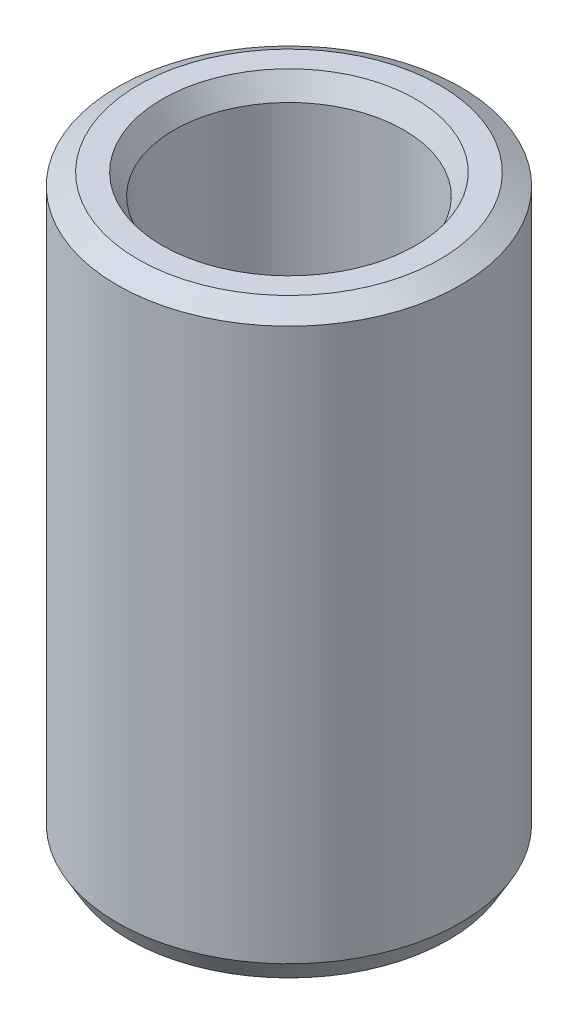
ISO-10303-21;
HEADER;
FILE_DESCRIPTION(('STEP AP214'),'2;1');
FILE_NAME('part.step','',(''),(''),'','','');
FILE_SCHEMA(('AUTOMOTIVE_DESIGN { 1 0 10303 214 1 1 1 1 }'));
ENDSEC;
DATA;
#1=APPLICATION_CONTEXT('core data for automotive mechanical design processes');
#2=APPLICATION_PROTOCOL_DEFINITION('international standard','automotive_design',2000,#1);
#3=PRODUCT_CONTEXT('',#1,'mechanical');
#4=PRODUCT('Part','Part','',(#3));
#5=PRODUCT_RELATED_PRODUCT_CATEGORY('part','',(#4));
#6=PRODUCT_DEFINITION_FORMATION('','',#4);
#7=PRODUCT_DEFINITION_CONTEXT('part definition',#1,'design');
#8=PRODUCT_DEFINITION('design','',#6,#7);
#9=PRODUCT_DEFINITION_SHAPE('','',#8);
#10=(LENGTH_UNIT() NAMED_UNIT(*) SI_UNIT(.MILLI.,.METRE.));
#11=(NAMED_UNIT(*) PLANE_ANGLE_UNIT() SI_UNIT($,.RADIAN.));
#12=(NAMED_UNIT(*) SI_UNIT($,.STERADIAN.) SOLID_ANGLE_UNIT());
#13=UNCERTAINTY_MEASURE_WITH_UNIT(LENGTH_MEASURE(1.E-05),#10,'distance_accuracy_value','');
#14=(GEOMETRIC_REPRESENTATION_CONTEXT(3) GLOBAL_UNCERTAINTY_ASSIGNED_CONTEXT((#13)) GLOBAL_UNIT_ASSIGNED_CONTEXT((#10,
#11,#12)) REPRESENTATION_CONTEXT('',''));
#15=CARTESIAN_POINT('',(0.,0.,0.));
#16=DIRECTION('',(0.,0.,1.));
#17=DIRECTION('',(1.,0.,0.));
#18=AXIS2_PLACEMENT_3D('',#15,#16,#17);
#19=CARTESIAN_POINT('',(0.,127.807900285613,0.));
#20=DIRECTION('',(0.,-1.,0.));
#21=DIRECTION('',(0.,0.,-1.));
#22=AXIS2_PLACEMENT_3D('',#19,#20,#21);
#23=CYLINDRICAL_SURFACE('',#22,37.5);
#24=CARTESIAN_POINT('',(0.,4.52768554825017,0.));
#25=DIRECTION('',(0.,1.,0.));
#26=DIRECTION('',(0.,0.,1.));
#27=AXIS2_PLACEMENT_3D('',#24,#25,#26);
#28=CIRCLE('',#27,37.5);
#29=CARTESIAN_POINT('',(0.,4.52768554825017,37.5));
#30=VERTEX_POINT('',#29);
#31=EDGE_CURVE('E10',#30,#30,#28,.T.);
#32=ORIENTED_EDGE('',*,*,#31,.T.);
#33=EDGE_LOOP('',(#32));
#34=FACE_BOUND('',#33,.T.);
#35=CARTESIAN_POINT('',(0.,125.193839815524,0.));
#36=DIRECTION('',(0.,1.,0.));
#37=DIRECTION('',(0.,0.,1.));
#38=AXIS2_PLACEMENT_3D('',#35,#36,#37);
#39=CIRCLE('',#38,37.5);
#40=CARTESIAN_POINT('',(0.,125.193839815524,37.5));
#41=VERTEX_POINT('',#40);
#42=EDGE_CURVE('E50',#41,#41,#39,.F.);
#43=ORIENTED_EDGE('',*,*,#42,.T.);
#44=EDGE_LOOP('',(#43));
#45=FACE_BOUND('',#44,.T.);
#46=ADVANCED_FACE('F39',(#34,#45),#23,.T.);
#47=CARTESIAN_POINT('',(0.,127.807900285613,0.));
#48=DIRECTION('',(0.,1.,0.));
#49=DIRECTION('',(0.,0.,1.));
#50=AXIS2_PLACEMENT_3D('',#47,#48,#49);
#51=PLANE('',#50);
#52=CARTESIAN_POINT('',(0.,127.807900285613,0.));
#53=DIRECTION('',(0.,1.,0.));
#54=DIRECTION('',(0.,0.,1.));
#55=AXIS2_PLACEMENT_3D('',#52,#53,#54);
#56=CIRCLE('',#55,27.709597500186);
#57=CARTESIAN_POINT('',(0.,127.807900285613,27.709597500186));
#58=VERTEX_POINT('',#57);
#59=EDGE_CURVE('E58',#58,#58,#56,.F.);
#60=ORIENTED_EDGE('',*,*,#59,.T.);
#61=EDGE_LOOP('',(#60));
#62=FACE_BOUND('',#61,.T.);
#63=CARTESIAN_POINT('',(0.,127.807900285613,0.));
#64=DIRECTION('',(0.,1.,0.));
#65=DIRECTION('',(0.,0.,1.));
#66=AXIS2_PLACEMENT_3D('',#63,#64,#65);
#67=CIRCLE('',#66,32.9723144517498);
#68=CARTESIAN_POINT('',(0.,127.807900285613,32.9723144517498));
#69=VERTEX_POINT('',#68);
#70=EDGE_CURVE('E61',#69,#69,#67,.T.);
#71=ORIENTED_EDGE('',*,*,#70,.T.);
#72=EDGE_LOOP('',(#71));
#73=FACE_BOUND('',#72,.T.);
#74=ADVANCED_FACE('F88',(#62,#73),#51,.T.);
#75=CARTESIAN_POINT('',(0.,0.,0.));
#76=DIRECTION('',(0.,1.,0.));
#77=DIRECTION('',(0.,0.,1.));
#78=AXIS2_PLACEMENT_3D('',#75,#76,#77);
#79=PLANE('',#78);
#80=CARTESIAN_POINT('',(0.,0.,0.));
#81=DIRECTION('',(0.,1.,0.));
#82=DIRECTION('',(0.,0.,1.));
#83=AXIS2_PLACEMENT_3D('',#80,#81,#82);
#84=CIRCLE('',#83,29.623222578348);
#85=CARTESIAN_POINT('',(0.,0.,29.623222578348));
#86=VERTEX_POINT('',#85);
#87=EDGE_CURVE('E51',#86,#86,#84,.T.);
#88=ORIENTED_EDGE('',*,*,#87,.T.);
#89=EDGE_LOOP('',(#88));
#90=FACE_BOUND('',#89,.T.);
#91=CARTESIAN_POINT('',(0.,0.,0.));
#92=DIRECTION('',(0.,1.,0.));
#93=DIRECTION('',(0.,0.,1.));
#94=AXIS2_PLACEMENT_3D('',#91,#92,#93);
#95=CIRCLE('',#94,34.8859395299118);
#96=CARTESIAN_POINT('',(0.,0.,34.8859395299118));
#97=VERTEX_POINT('',#96);
#98=EDGE_CURVE('E54',#97,#97,#95,.F.);
#99=ORIENTED_EDGE('',*,*,#98,.T.);
#100=EDGE_LOOP('',(#99));
#101=FACE_BOUND('',#100,.T.);
#102=ADVANCED_FACE('F83',(#90,#101),#79,.F.);
#103=CARTESIAN_POINT('',(0.,127.807900285613,0.));
#104=DIRECTION('',(0.,-1.,0.));
#105=DIRECTION('',(0.,0.,-1.));
#106=AXIS2_PLACEMENT_3D('',#103,#104,#105);
#107=CYLINDRICAL_SURFACE('',#106,25.0955370300978);
#108=CARTESIAN_POINT('',(0.,123.280214737362,0.));
#109=DIRECTION('',(0.,1.,0.));
#110=DIRECTION('',(0.,0.,1.));
#111=AXIS2_PLACEMENT_3D('',#108,#109,#110);
#112=CIRCLE('',#111,25.0955370300978);
#113=CARTESIAN_POINT('',(0.,123.280214737362,25.0955370300978));
#114=VERTEX_POINT('',#113);
#115=EDGE_CURVE('E67',#114,#114,#112,.T.);
#116=ORIENTED_EDGE('',*,*,#115,.T.);
#117=EDGE_LOOP('',(#116));
#118=FACE_BOUND('',#117,.T.);
#119=CARTESIAN_POINT('',(0.,2.61406047008828,0.));
#120=DIRECTION('',(0.,1.,0.));
#121=DIRECTION('',(0.,0.,1.));
#122=AXIS2_PLACEMENT_3D('',#119,#120,#121);
#123=CIRCLE('',#122,25.0955370300978);
#124=CARTESIAN_POINT('',(0.,2.61406047008828,25.0955370300978));
#125=VERTEX_POINT('',#124);
#126=EDGE_CURVE('E69',#125,#125,#123,.F.);
#127=ORIENTED_EDGE('',*,*,#126,.T.);
#128=EDGE_LOOP('',(#127));
#129=FACE_BOUND('',#128,.T.);
#130=ADVANCED_FACE('F71',(#118,#129),#107,.F.);
#131=CARTESIAN_POINT('',(0.,123.280214737362,0.));
#132=DIRECTION('',(0.,1.,0.));
#133=DIRECTION('',(0.,0.,1.));
#134=AXIS2_PLACEMENT_3D('',#131,#132,#133);
#135=CONICAL_SURFACE('',#134,25.0955370300978,0.523598775598301);
#136=ORIENTED_EDGE('',*,*,#59,.F.);
#137=EDGE_LOOP('',(#136));
#138=FACE_BOUND('',#137,.T.);
#139=ORIENTED_EDGE('',*,*,#115,.F.);
#140=EDGE_LOOP('',(#139));
#141=FACE_BOUND('',#140,.T.);
#142=ADVANCED_FACE('F77',(#138,#141),#135,.F.);
#143=CARTESIAN_POINT('',(0.,0.,0.));
#144=DIRECTION('',(0.,-1.,0.));
#145=DIRECTION('',(0.,0.,-1.));
#146=AXIS2_PLACEMENT_3D('',#143,#144,#145);
#147=CONICAL_SURFACE('',#146,29.623222578348,1.04719755119659);
#148=ORIENTED_EDGE('',*,*,#126,.F.);
#149=EDGE_LOOP('',(#148));
#150=FACE_BOUND('',#149,.T.);
#151=ORIENTED_EDGE('',*,*,#87,.F.);
#152=EDGE_LOOP('',(#151));
#153=FACE_BOUND('',#152,.T.);
#154=ADVANCED_FACE('F73',(#150,#153),#147,.F.);
#155=CARTESIAN_POINT('',(0.,4.52768554825017,0.));
#156=DIRECTION('',(0.,1.,0.));
#157=DIRECTION('',(0.,0.,1.));
#158=AXIS2_PLACEMENT_3D('',#155,#156,#157);
#159=CONICAL_SURFACE('',#158,37.5,0.523598775598303);
#160=ORIENTED_EDGE('',*,*,#98,.F.);
#161=EDGE_LOOP('',(#160));
#162=FACE_BOUND('',#161,.T.);
#163=ORIENTED_EDGE('',*,*,#31,.F.);
#164=EDGE_LOOP('',(#163));
#165=FACE_BOUND('',#164,.T.);
#166=ADVANCED_FACE('F76',(#162,#165),#159,.T.);
#167=CARTESIAN_POINT('',(0.,127.807900285613,0.));
#168=DIRECTION('',(0.,-1.,0.));
#169=DIRECTION('',(0.,0.,-1.));
#170=AXIS2_PLACEMENT_3D('',#167,#168,#169);
#171=CONICAL_SURFACE('',#170,32.9723144517498,1.0471975511966);
#172=ORIENTED_EDGE('',*,*,#42,.F.);
#173=EDGE_LOOP('',(#172));
#174=FACE_BOUND('',#173,.T.);
#175=ORIENTED_EDGE('',*,*,#70,.F.);
#176=EDGE_LOOP('',(#175));
#177=FACE_BOUND('',#176,.T.);
#178=ADVANCED_FACE('F45',(#174,#177),#171,.T.);
#179=CLOSED_SHELL('',(#46,#74,#102,#130,#142,#154,#166,#178));
#180=MANIFOLD_SOLID_BREP('B2',#179);
#181=ADVANCED_BREP_SHAPE_REPRESENTATION('',(#18,#180),#14);
#182=SHAPE_DEFINITION_REPRESENTATION(#9,#181);
ENDSEC;
END-ISO-10303-21;
